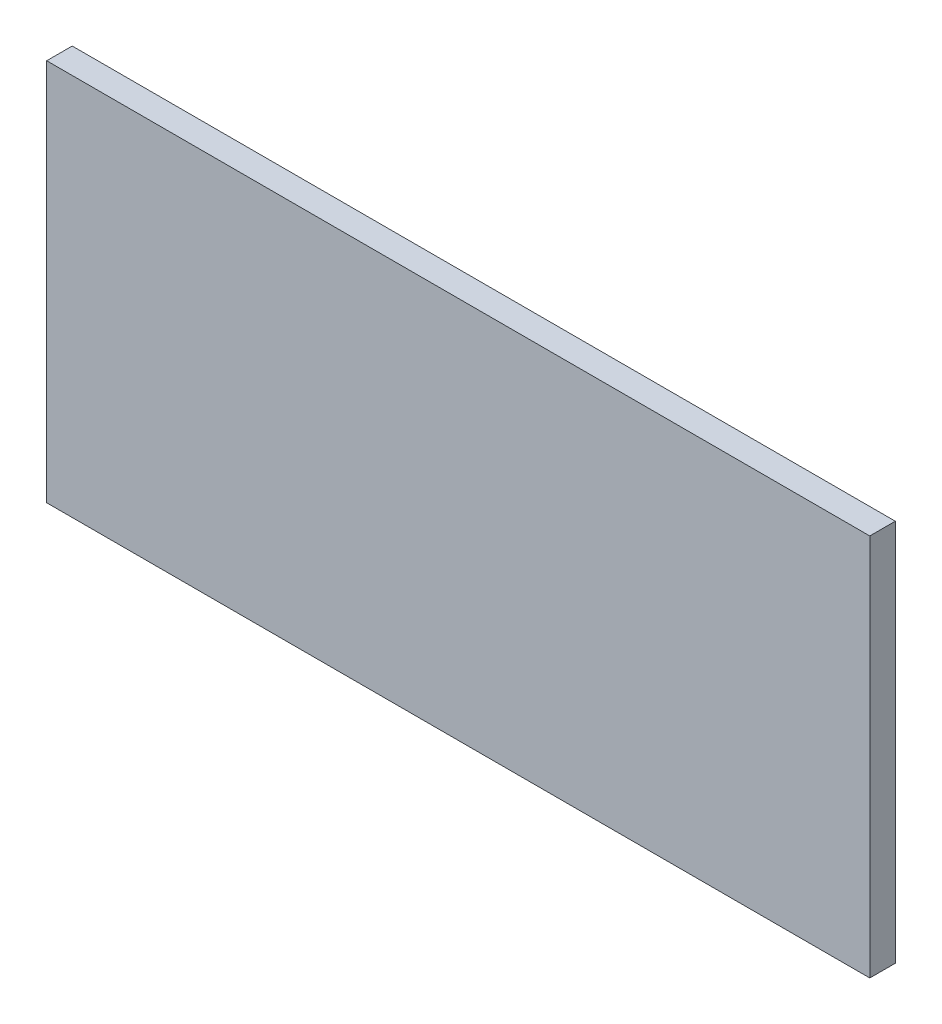
ISO-10303-21;
HEADER;
FILE_DESCRIPTION(('STEP AP214'),'2;1');
FILE_NAME('part.step','',(''),(''),'','','');
FILE_SCHEMA(('AUTOMOTIVE_DESIGN { 1 0 10303 214 1 1 1 1 }'));
ENDSEC;
DATA;
#1=APPLICATION_CONTEXT('core data for automotive mechanical design processes');
#2=APPLICATION_PROTOCOL_DEFINITION('international standard','automotive_design',2000,#1);
#3=PRODUCT_CONTEXT('',#1,'mechanical');
#4=PRODUCT('Part','Part','',(#3));
#5=PRODUCT_RELATED_PRODUCT_CATEGORY('part','',(#4));
#6=PRODUCT_DEFINITION_FORMATION('','',#4);
#7=PRODUCT_DEFINITION_CONTEXT('part definition',#1,'design');
#8=PRODUCT_DEFINITION('design','',#6,#7);
#9=PRODUCT_DEFINITION_SHAPE('','',#8);
#10=(LENGTH_UNIT() NAMED_UNIT(*) SI_UNIT(.MILLI.,.METRE.));
#11=(NAMED_UNIT(*) PLANE_ANGLE_UNIT() SI_UNIT($,.RADIAN.));
#12=(NAMED_UNIT(*) SI_UNIT($,.STERADIAN.) SOLID_ANGLE_UNIT());
#13=UNCERTAINTY_MEASURE_WITH_UNIT(LENGTH_MEASURE(1.E-05),#10,'distance_accuracy_value','');
#14=(GEOMETRIC_REPRESENTATION_CONTEXT(3) GLOBAL_UNCERTAINTY_ASSIGNED_CONTEXT((#13)) GLOBAL_UNIT_ASSIGNED_CONTEXT((#10,
#11,#12)) REPRESENTATION_CONTEXT('',''));
#15=CARTESIAN_POINT('',(0.,0.,0.));
#16=DIRECTION('',(0.,0.,1.));
#17=DIRECTION('',(1.,0.,0.));
#18=AXIS2_PLACEMENT_3D('',#15,#16,#17);
#19=CARTESIAN_POINT('',(-356.869887409822,239.706601466993,20.));
#20=DIRECTION('',(1.,0.,0.));
#21=DIRECTION('',(0.,1.,0.));
#22=AXIS2_PLACEMENT_3D('',#19,#20,#21);
#23=PLANE('',#22);
#24=DIRECTION('',(0.,-1.,0.));
#25=VECTOR('',#24,1.);
#26=CARTESIAN_POINT('',(-356.869887409822,239.706601466993,0.));
#27=LINE('',#26,#25);
#28=CARTESIAN_POINT('',(-356.869887409822,239.706601466993,0.));
#29=VERTEX_POINT('',#28);
#30=CARTESIAN_POINT('',(-356.869887409822,-60.2933985330074,0.));
#31=VERTEX_POINT('',#30);
#32=EDGE_CURVE('E96',#29,#31,#27,.T.);
#33=ORIENTED_EDGE('',*,*,#32,.T.);
#34=DIRECTION('',(0.,0.,-1.));
#35=VECTOR('',#34,1.);
#36=CARTESIAN_POINT('',(-356.869887409822,-60.2933985330074,20.));
#37=LINE('',#36,#35);
#38=CARTESIAN_POINT('',(-356.869887409822,-60.2933985330074,20.));
#39=VERTEX_POINT('',#38);
#40=EDGE_CURVE('E11',#39,#31,#37,.T.);
#41=ORIENTED_EDGE('',*,*,#40,.F.);
#42=DIRECTION('',(0.,-1.,0.));
#43=VECTOR('',#42,1.);
#44=CARTESIAN_POINT('',(-356.869887409822,239.706601466993,20.));
#45=LINE('',#44,#43);
#46=CARTESIAN_POINT('',(-356.869887409822,239.706601466993,20.));
#47=VERTEX_POINT('',#46);
#48=EDGE_CURVE('E84',#47,#39,#45,.T.);
#49=ORIENTED_EDGE('',*,*,#48,.F.);
#50=DIRECTION('',(0.,0.,-1.));
#51=VECTOR('',#50,1.);
#52=CARTESIAN_POINT('',(-356.869887409822,239.706601466993,20.));
#53=LINE('',#52,#51);
#54=EDGE_CURVE('E92',#47,#29,#53,.T.);
#55=ORIENTED_EDGE('',*,*,#54,.T.);
#56=EDGE_LOOP('',(#33,#41,#49,#55));
#57=FACE_BOUND('',#56,.T.);
#58=ADVANCED_FACE('F33',(#57),#23,.F.);
#59=CARTESIAN_POINT('',(-356.869887409822,-60.2933985330074,20.));
#60=DIRECTION('',(0.,1.,0.));
#61=DIRECTION('',(0.,0.,1.));
#62=AXIS2_PLACEMENT_3D('',#59,#60,#61);
#63=PLANE('',#62);
#64=DIRECTION('',(1.,0.,0.));
#65=VECTOR('',#64,1.);
#66=CARTESIAN_POINT('',(-356.869887409822,-60.2933985330074,0.));
#67=LINE('',#66,#65);
#68=CARTESIAN_POINT('',(288.130112590178,-60.2933985330074,0.));
#69=VERTEX_POINT('',#68);
#70=EDGE_CURVE('E88',#31,#69,#67,.T.);
#71=ORIENTED_EDGE('',*,*,#70,.T.);
#72=DIRECTION('',(0.,0.,-1.));
#73=VECTOR('',#72,1.);
#74=CARTESIAN_POINT('',(288.130112590178,-60.2933985330074,20.));
#75=LINE('',#74,#73);
#76=CARTESIAN_POINT('',(288.130112590178,-60.2933985330074,20.));
#77=VERTEX_POINT('',#76);
#78=EDGE_CURVE('E41',#77,#69,#75,.T.);
#79=ORIENTED_EDGE('',*,*,#78,.F.);
#80=DIRECTION('',(1.,0.,0.));
#81=VECTOR('',#80,1.);
#82=CARTESIAN_POINT('',(-356.869887409822,-60.2933985330074,20.));
#83=LINE('',#82,#81);
#84=EDGE_CURVE('E79',#39,#77,#83,.T.);
#85=ORIENTED_EDGE('',*,*,#84,.F.);
#86=ORIENTED_EDGE('',*,*,#40,.T.);
#87=EDGE_LOOP('',(#71,#79,#85,#86));
#88=FACE_BOUND('',#87,.T.);
#89=ADVANCED_FACE('F87',(#88),#63,.F.);
#90=CARTESIAN_POINT('',(288.130112590178,239.706601466993,20.));
#91=DIRECTION('',(-1.,0.,0.));
#92=DIRECTION('',(0.,0.,1.));
#93=AXIS2_PLACEMENT_3D('',#90,#91,#92);
#94=PLANE('',#93);
#95=DIRECTION('',(0.,1.,0.));
#96=VECTOR('',#95,1.);
#97=CARTESIAN_POINT('',(288.130112590178,239.706601466993,0.));
#98=LINE('',#97,#96);
#99=CARTESIAN_POINT('',(288.130112590178,239.706601466993,0.));
#100=VERTEX_POINT('',#99);
#101=EDGE_CURVE('E66',#69,#100,#98,.T.);
#102=ORIENTED_EDGE('',*,*,#101,.T.);
#103=DIRECTION('',(0.,0.,-1.));
#104=VECTOR('',#103,1.);
#105=CARTESIAN_POINT('',(288.130112590178,239.706601466993,20.));
#106=LINE('',#105,#104);
#107=CARTESIAN_POINT('',(288.130112590178,239.706601466993,20.));
#108=VERTEX_POINT('',#107);
#109=EDGE_CURVE('E89',#108,#100,#106,.T.);
#110=ORIENTED_EDGE('',*,*,#109,.F.);
#111=DIRECTION('',(0.,1.,0.));
#112=VECTOR('',#111,1.);
#113=CARTESIAN_POINT('',(288.130112590178,239.706601466993,20.));
#114=LINE('',#113,#112);
#115=EDGE_CURVE('E82',#77,#108,#114,.T.);
#116=ORIENTED_EDGE('',*,*,#115,.F.);
#117=ORIENTED_EDGE('',*,*,#78,.T.);
#118=EDGE_LOOP('',(#102,#110,#116,#117));
#119=FACE_BOUND('',#118,.T.);
#120=ADVANCED_FACE('F90',(#119),#94,.F.);
#121=CARTESIAN_POINT('',(-356.869887409822,239.706601466993,20.));
#122=DIRECTION('',(0.,-1.,0.));
#123=DIRECTION('',(0.,0.,-1.));
#124=AXIS2_PLACEMENT_3D('',#121,#122,#123);
#125=PLANE('',#124);
#126=DIRECTION('',(-1.,0.,0.));
#127=VECTOR('',#126,1.);
#128=CARTESIAN_POINT('',(-356.869887409822,239.706601466993,0.));
#129=LINE('',#128,#127);
#130=EDGE_CURVE('E72',#100,#29,#129,.T.);
#131=ORIENTED_EDGE('',*,*,#130,.T.);
#132=ORIENTED_EDGE('',*,*,#54,.F.);
#133=DIRECTION('',(-1.,0.,0.));
#134=VECTOR('',#133,1.);
#135=CARTESIAN_POINT('',(-356.869887409822,239.706601466993,20.));
#136=LINE('',#135,#134);
#137=EDGE_CURVE('E49',#108,#47,#136,.T.);
#138=ORIENTED_EDGE('',*,*,#137,.F.);
#139=ORIENTED_EDGE('',*,*,#109,.T.);
#140=EDGE_LOOP('',(#131,#132,#138,#139));
#141=FACE_BOUND('',#140,.T.);
#142=ADVANCED_FACE('F103',(#141),#125,.F.);
#143=CARTESIAN_POINT('',(0.,0.,20.));
#144=DIRECTION('',(0.,0.,1.));
#145=DIRECTION('',(1.,0.,0.));
#146=AXIS2_PLACEMENT_3D('',#143,#144,#145);
#147=PLANE('',#146);
#148=ORIENTED_EDGE('',*,*,#48,.T.);
#149=ORIENTED_EDGE('',*,*,#84,.T.);
#150=ORIENTED_EDGE('',*,*,#115,.T.);
#151=ORIENTED_EDGE('',*,*,#137,.T.);
#152=EDGE_LOOP('',(#148,#149,#150,#151));
#153=FACE_BOUND('',#152,.T.);
#154=ADVANCED_FACE('F80',(#153),#147,.T.);
#155=CARTESIAN_POINT('',(0.,0.,0.));
#156=DIRECTION('',(0.,0.,1.));
#157=DIRECTION('',(1.,0.,0.));
#158=AXIS2_PLACEMENT_3D('',#155,#156,#157);
#159=PLANE('',#158);
#160=ORIENTED_EDGE('',*,*,#32,.F.);
#161=ORIENTED_EDGE('',*,*,#130,.F.);
#162=ORIENTED_EDGE('',*,*,#101,.F.);
#163=ORIENTED_EDGE('',*,*,#70,.F.);
#164=EDGE_LOOP('',(#160,#161,#162,#163));
#165=FACE_BOUND('',#164,.T.);
#166=ADVANCED_FACE('F106',(#165),#159,.F.);
#167=CLOSED_SHELL('',(#58,#89,#120,#142,#154,#166));
#168=MANIFOLD_SOLID_BREP('B2',#167);
#169=ADVANCED_BREP_SHAPE_REPRESENTATION('',(#18,#168),#14);
#170=SHAPE_DEFINITION_REPRESENTATION(#9,#169);
ENDSEC;
END-ISO-10303-21;
